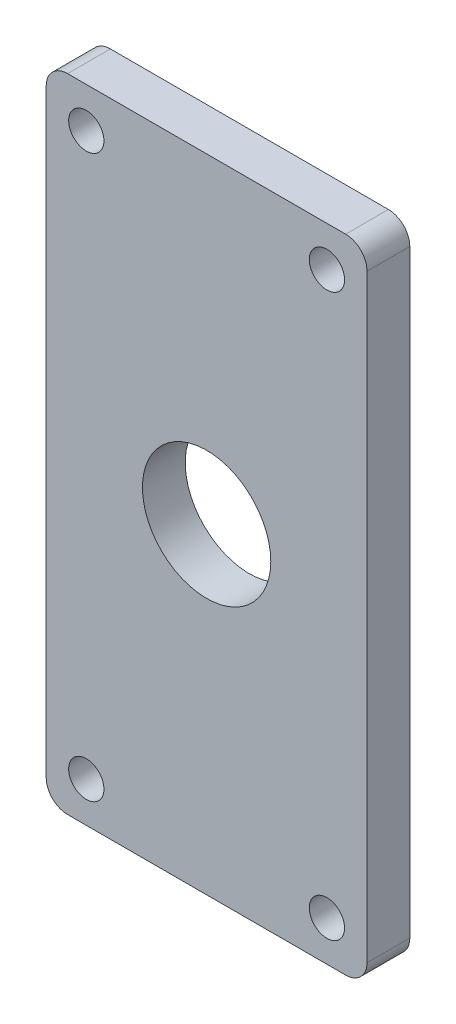
ISO-10303-21;
HEADER;
FILE_DESCRIPTION(('STEP AP214'),'2;1');
FILE_NAME('part.step','',(''),(''),'','','');
FILE_SCHEMA(('AUTOMOTIVE_DESIGN { 1 0 10303 214 1 1 1 1 }'));
ENDSEC;
DATA;
#1=APPLICATION_CONTEXT('core data for automotive mechanical design processes');
#2=APPLICATION_PROTOCOL_DEFINITION('international standard','automotive_design',2000,#1);
#3=PRODUCT_CONTEXT('',#1,'mechanical');
#4=PRODUCT('Part','Part','',(#3));
#5=PRODUCT_RELATED_PRODUCT_CATEGORY('part','',(#4));
#6=PRODUCT_DEFINITION_FORMATION('','',#4);
#7=PRODUCT_DEFINITION_CONTEXT('part definition',#1,'design');
#8=PRODUCT_DEFINITION('design','',#6,#7);
#9=PRODUCT_DEFINITION_SHAPE('','',#8);
#10=(LENGTH_UNIT() NAMED_UNIT(*) SI_UNIT(.MILLI.,.METRE.));
#11=(NAMED_UNIT(*) PLANE_ANGLE_UNIT() SI_UNIT($,.RADIAN.));
#12=(NAMED_UNIT(*) SI_UNIT($,.STERADIAN.) SOLID_ANGLE_UNIT());
#13=UNCERTAINTY_MEASURE_WITH_UNIT(LENGTH_MEASURE(1.E-05),#10,'distance_accuracy_value','');
#14=(GEOMETRIC_REPRESENTATION_CONTEXT(3) GLOBAL_UNCERTAINTY_ASSIGNED_CONTEXT((#13)) GLOBAL_UNIT_ASSIGNED_CONTEXT((#10,
#11,#12)) REPRESENTATION_CONTEXT('',''));
#15=CARTESIAN_POINT('',(0.,0.,0.));
#16=DIRECTION('',(0.,0.,1.));
#17=DIRECTION('',(1.,0.,0.));
#18=AXIS2_PLACEMENT_3D('',#15,#16,#17);
#19=CARTESIAN_POINT('',(-13.,-28.,4.));
#20=DIRECTION('',(0.,0.,-1.));
#21=DIRECTION('',(-1.,0.,0.));
#22=AXIS2_PLACEMENT_3D('',#19,#20,#21);
#23=CYLINDRICAL_SURFACE('',#22,2.);
#24=DIRECTION('',(0.,0.,1.));
#25=VECTOR('',#24,1.);
#26=CARTESIAN_POINT('',(-15.,-28.,4.));
#27=LINE('',#26,#25);
#28=CARTESIAN_POINT('',(-15.,-28.,0.));
#29=VERTEX_POINT('',#28);
#30=CARTESIAN_POINT('',(-15.,-28.,4.));
#31=VERTEX_POINT('',#30);
#32=EDGE_CURVE('E156',#29,#31,#27,.T.);
#33=ORIENTED_EDGE('',*,*,#32,.F.);
#34=CARTESIAN_POINT('',(-13.,-28.,0.));
#35=DIRECTION('',(0.,0.,1.));
#36=DIRECTION('',(1.,0.,0.));
#37=AXIS2_PLACEMENT_3D('',#34,#35,#36);
#38=CIRCLE('',#37,2.);
#39=CARTESIAN_POINT('',(-13.,-30.,0.));
#40=VERTEX_POINT('',#39);
#41=EDGE_CURVE('E46',#40,#29,#38,.F.);
#42=ORIENTED_EDGE('',*,*,#41,.F.);
#43=DIRECTION('',(0.,0.,1.));
#44=VECTOR('',#43,1.);
#45=CARTESIAN_POINT('',(-13.,-30.,4.));
#46=LINE('',#45,#44);
#47=CARTESIAN_POINT('',(-13.,-30.,4.));
#48=VERTEX_POINT('',#47);
#49=EDGE_CURVE('E159',#48,#40,#46,.F.);
#50=ORIENTED_EDGE('',*,*,#49,.F.);
#51=CARTESIAN_POINT('',(-13.,-28.,4.));
#52=DIRECTION('',(0.,0.,1.));
#53=DIRECTION('',(1.,0.,0.));
#54=AXIS2_PLACEMENT_3D('',#51,#52,#53);
#55=CIRCLE('',#54,2.);
#56=EDGE_CURVE('E11',#31,#48,#55,.T.);
#57=ORIENTED_EDGE('',*,*,#56,.F.);
#58=EDGE_LOOP('',(#33,#42,#50,#57));
#59=FACE_BOUND('',#58,.T.);
#60=ADVANCED_FACE('F39',(#59),#23,.T.);
#61=CARTESIAN_POINT('',(-13.,28.,4.));
#62=DIRECTION('',(0.,0.,1.));
#63=DIRECTION('',(1.,0.,0.));
#64=AXIS2_PLACEMENT_3D('',#61,#62,#63);
#65=CYLINDRICAL_SURFACE('',#64,2.);
#66=DIRECTION('',(0.,0.,1.));
#67=VECTOR('',#66,1.);
#68=CARTESIAN_POINT('',(-13.,30.,4.));
#69=LINE('',#68,#67);
#70=CARTESIAN_POINT('',(-13.,30.,0.));
#71=VERTEX_POINT('',#70);
#72=CARTESIAN_POINT('',(-13.,30.,4.));
#73=VERTEX_POINT('',#72);
#74=EDGE_CURVE('E147',#71,#73,#69,.T.);
#75=ORIENTED_EDGE('',*,*,#74,.F.);
#76=CARTESIAN_POINT('',(-13.,28.,0.));
#77=DIRECTION('',(0.,0.,1.));
#78=DIRECTION('',(1.,0.,0.));
#79=AXIS2_PLACEMENT_3D('',#76,#77,#78);
#80=CIRCLE('',#79,2.);
#81=CARTESIAN_POINT('',(-15.,28.,0.));
#82=VERTEX_POINT('',#81);
#83=EDGE_CURVE('E108',#82,#71,#80,.F.);
#84=ORIENTED_EDGE('',*,*,#83,.F.);
#85=DIRECTION('',(0.,0.,1.));
#86=VECTOR('',#85,1.);
#87=CARTESIAN_POINT('',(-15.,28.,4.));
#88=LINE('',#87,#86);
#89=CARTESIAN_POINT('',(-15.,28.,4.));
#90=VERTEX_POINT('',#89);
#91=EDGE_CURVE('E149',#90,#82,#88,.F.);
#92=ORIENTED_EDGE('',*,*,#91,.F.);
#93=CARTESIAN_POINT('',(-13.,28.,4.));
#94=DIRECTION('',(0.,0.,1.));
#95=DIRECTION('',(1.,0.,0.));
#96=AXIS2_PLACEMENT_3D('',#93,#94,#95);
#97=CIRCLE('',#96,2.);
#98=EDGE_CURVE('E153',#73,#90,#97,.T.);
#99=ORIENTED_EDGE('',*,*,#98,.F.);
#100=EDGE_LOOP('',(#75,#84,#92,#99));
#101=FACE_BOUND('',#100,.T.);
#102=ADVANCED_FACE('F196',(#101),#65,.T.);
#103=CARTESIAN_POINT('',(13.,-28.,4.));
#104=DIRECTION('',(0.,0.,-1.));
#105=DIRECTION('',(-1.,0.,0.));
#106=AXIS2_PLACEMENT_3D('',#103,#104,#105);
#107=CYLINDRICAL_SURFACE('',#106,2.);
#108=DIRECTION('',(0.,0.,-1.));
#109=VECTOR('',#108,1.);
#110=CARTESIAN_POINT('',(15.,-28.,4.));
#111=LINE('',#110,#109);
#112=CARTESIAN_POINT('',(15.,-28.,4.));
#113=VERTEX_POINT('',#112);
#114=CARTESIAN_POINT('',(15.,-28.,0.));
#115=VERTEX_POINT('',#114);
#116=EDGE_CURVE('E123',#113,#115,#111,.T.);
#117=ORIENTED_EDGE('',*,*,#116,.F.);
#118=CARTESIAN_POINT('',(13.,-28.,4.));
#119=DIRECTION('',(0.,0.,1.));
#120=DIRECTION('',(1.,0.,0.));
#121=AXIS2_PLACEMENT_3D('',#118,#119,#120);
#122=CIRCLE('',#121,2.);
#123=CARTESIAN_POINT('',(13.,-30.,4.));
#124=VERTEX_POINT('',#123);
#125=EDGE_CURVE('E142',#124,#113,#122,.T.);
#126=ORIENTED_EDGE('',*,*,#125,.F.);
#127=DIRECTION('',(0.,0.,-1.));
#128=VECTOR('',#127,1.);
#129=CARTESIAN_POINT('',(13.,-30.,4.));
#130=LINE('',#129,#128);
#131=CARTESIAN_POINT('',(13.,-30.,0.));
#132=VERTEX_POINT('',#131);
#133=EDGE_CURVE('E139',#132,#124,#130,.F.);
#134=ORIENTED_EDGE('',*,*,#133,.F.);
#135=CARTESIAN_POINT('',(13.,-28.,0.));
#136=DIRECTION('',(0.,0.,1.));
#137=DIRECTION('',(1.,0.,0.));
#138=AXIS2_PLACEMENT_3D('',#135,#136,#137);
#139=CIRCLE('',#138,2.);
#140=EDGE_CURVE('E144',#115,#132,#139,.F.);
#141=ORIENTED_EDGE('',*,*,#140,.F.);
#142=EDGE_LOOP('',(#117,#126,#134,#141));
#143=FACE_BOUND('',#142,.T.);
#144=ADVANCED_FACE('F190',(#143),#107,.T.);
#145=CARTESIAN_POINT('',(13.,28.,4.));
#146=DIRECTION('',(0.,0.,1.));
#147=DIRECTION('',(1.,0.,0.));
#148=AXIS2_PLACEMENT_3D('',#145,#146,#147);
#149=CYLINDRICAL_SURFACE('',#148,2.);
#150=DIRECTION('',(0.,0.,-1.));
#151=VECTOR('',#150,1.);
#152=CARTESIAN_POINT('',(13.,30.,4.));
#153=LINE('',#152,#151);
#154=CARTESIAN_POINT('',(13.,30.,4.));
#155=VERTEX_POINT('',#154);
#156=CARTESIAN_POINT('',(13.,30.,0.));
#157=VERTEX_POINT('',#156);
#158=EDGE_CURVE('E120',#155,#157,#153,.T.);
#159=ORIENTED_EDGE('',*,*,#158,.F.);
#160=CARTESIAN_POINT('',(13.,28.,4.));
#161=DIRECTION('',(0.,0.,1.));
#162=DIRECTION('',(1.,0.,0.));
#163=AXIS2_PLACEMENT_3D('',#160,#161,#162);
#164=CIRCLE('',#163,2.);
#165=CARTESIAN_POINT('',(15.,28.,4.));
#166=VERTEX_POINT('',#165);
#167=EDGE_CURVE('E124',#166,#155,#164,.T.);
#168=ORIENTED_EDGE('',*,*,#167,.F.);
#169=DIRECTION('',(0.,0.,-1.));
#170=VECTOR('',#169,1.);
#171=CARTESIAN_POINT('',(15.,28.,4.));
#172=LINE('',#171,#170);
#173=CARTESIAN_POINT('',(15.,28.,0.));
#174=VERTEX_POINT('',#173);
#175=EDGE_CURVE('E122',#174,#166,#172,.F.);
#176=ORIENTED_EDGE('',*,*,#175,.F.);
#177=CARTESIAN_POINT('',(13.,28.,0.));
#178=DIRECTION('',(0.,0.,1.));
#179=DIRECTION('',(1.,0.,0.));
#180=AXIS2_PLACEMENT_3D('',#177,#178,#179);
#181=CIRCLE('',#180,2.);
#182=EDGE_CURVE('E105',#157,#174,#181,.F.);
#183=ORIENTED_EDGE('',*,*,#182,.F.);
#184=EDGE_LOOP('',(#159,#168,#176,#183));
#185=FACE_BOUND('',#184,.T.);
#186=ADVANCED_FACE('F118',(#185),#149,.T.);
#187=CARTESIAN_POINT('',(0.,-30.,4.));
#188=DIRECTION('',(0.,1.,0.));
#189=DIRECTION('',(0.,0.,1.));
#190=AXIS2_PLACEMENT_3D('',#187,#188,#189);
#191=PLANE('',#190);
#192=DIRECTION('',(1.,0.,0.));
#193=VECTOR('',#192,1.);
#194=CARTESIAN_POINT('',(0.,-30.,4.));
#195=LINE('',#194,#193);
#196=EDGE_CURVE('E167',#48,#124,#195,.T.);
#197=ORIENTED_EDGE('',*,*,#196,.F.);
#198=ORIENTED_EDGE('',*,*,#49,.T.);
#199=DIRECTION('',(1.,0.,0.));
#200=VECTOR('',#199,1.);
#201=CARTESIAN_POINT('',(0.,-30.,0.));
#202=LINE('',#201,#200);
#203=EDGE_CURVE('E161',#40,#132,#202,.T.);
#204=ORIENTED_EDGE('',*,*,#203,.T.);
#205=ORIENTED_EDGE('',*,*,#133,.T.);
#206=EDGE_LOOP('',(#197,#198,#204,#205));
#207=FACE_BOUND('',#206,.T.);
#208=ADVANCED_FACE('F193',(#207),#191,.F.);
#209=CARTESIAN_POINT('',(15.,0.,4.));
#210=DIRECTION('',(-1.,0.,0.));
#211=DIRECTION('',(0.,0.,1.));
#212=AXIS2_PLACEMENT_3D('',#209,#210,#211);
#213=PLANE('',#212);
#214=DIRECTION('',(0.,1.,0.));
#215=VECTOR('',#214,1.);
#216=CARTESIAN_POINT('',(15.,0.,4.));
#217=LINE('',#216,#215);
#218=EDGE_CURVE('E171',#113,#166,#217,.T.);
#219=ORIENTED_EDGE('',*,*,#218,.F.);
#220=ORIENTED_EDGE('',*,*,#116,.T.);
#221=DIRECTION('',(0.,1.,0.));
#222=VECTOR('',#221,1.);
#223=CARTESIAN_POINT('',(15.,0.,0.));
#224=LINE('',#223,#222);
#225=EDGE_CURVE('E114',#115,#174,#224,.T.);
#226=ORIENTED_EDGE('',*,*,#225,.T.);
#227=ORIENTED_EDGE('',*,*,#175,.T.);
#228=EDGE_LOOP('',(#219,#220,#226,#227));
#229=FACE_BOUND('',#228,.T.);
#230=ADVANCED_FACE('F185',(#229),#213,.F.);
#231=CARTESIAN_POINT('',(0.,30.,4.));
#232=DIRECTION('',(0.,1.,0.));
#233=DIRECTION('',(0.,0.,1.));
#234=AXIS2_PLACEMENT_3D('',#231,#232,#233);
#235=PLANE('',#234);
#236=DIRECTION('',(1.,0.,0.));
#237=VECTOR('',#236,1.);
#238=CARTESIAN_POINT('',(0.,30.,0.));
#239=LINE('',#238,#237);
#240=EDGE_CURVE('E100',#71,#157,#239,.T.);
#241=ORIENTED_EDGE('',*,*,#240,.F.);
#242=ORIENTED_EDGE('',*,*,#74,.T.);
#243=DIRECTION('',(1.,0.,0.));
#244=VECTOR('',#243,1.);
#245=CARTESIAN_POINT('',(0.,30.,4.));
#246=LINE('',#245,#244);
#247=EDGE_CURVE('E128',#73,#155,#246,.T.);
#248=ORIENTED_EDGE('',*,*,#247,.T.);
#249=ORIENTED_EDGE('',*,*,#158,.T.);
#250=EDGE_LOOP('',(#241,#242,#248,#249));
#251=FACE_BOUND('',#250,.T.);
#252=ADVANCED_FACE('F126',(#251),#235,.T.);
#253=CARTESIAN_POINT('',(0.,0.,4.));
#254=DIRECTION('',(0.,0.,-1.));
#255=DIRECTION('',(-1.,0.,0.));
#256=AXIS2_PLACEMENT_3D('',#253,#254,#255);
#257=CYLINDRICAL_SURFACE('',#256,6.);
#258=CARTESIAN_POINT('',(0.,0.,4.));
#259=DIRECTION('',(0.,0.,1.));
#260=DIRECTION('',(1.,0.,0.));
#261=AXIS2_PLACEMENT_3D('',#258,#259,#260);
#262=CIRCLE('',#261,6.);
#263=CARTESIAN_POINT('',(6.,0.,4.));
#264=VERTEX_POINT('',#263);
#265=EDGE_CURVE('E165',#264,#264,#262,.T.);
#266=ORIENTED_EDGE('',*,*,#265,.T.);
#267=EDGE_LOOP('',(#266));
#268=FACE_BOUND('',#267,.T.);
#269=CARTESIAN_POINT('',(0.,0.,0.));
#270=DIRECTION('',(0.,0.,1.));
#271=DIRECTION('',(1.,0.,0.));
#272=AXIS2_PLACEMENT_3D('',#269,#270,#271);
#273=CIRCLE('',#272,6.);
#274=CARTESIAN_POINT('',(6.,0.,0.));
#275=VERTEX_POINT('',#274);
#276=EDGE_CURVE('E179',#275,#275,#273,.T.);
#277=ORIENTED_EDGE('',*,*,#276,.F.);
#278=EDGE_LOOP('',(#277));
#279=FACE_BOUND('',#278,.T.);
#280=ADVANCED_FACE('F206',(#268,#279),#257,.F.);
#281=CARTESIAN_POINT('',(-15.,0.,4.));
#282=DIRECTION('',(-1.,0.,0.));
#283=DIRECTION('',(0.,0.,1.));
#284=AXIS2_PLACEMENT_3D('',#281,#282,#283);
#285=PLANE('',#284);
#286=DIRECTION('',(0.,1.,0.));
#287=VECTOR('',#286,1.);
#288=CARTESIAN_POINT('',(-15.,0.,0.));
#289=LINE('',#288,#287);
#290=EDGE_CURVE('E113',#29,#82,#289,.T.);
#291=ORIENTED_EDGE('',*,*,#290,.F.);
#292=ORIENTED_EDGE('',*,*,#32,.T.);
#293=DIRECTION('',(0.,1.,0.));
#294=VECTOR('',#293,1.);
#295=CARTESIAN_POINT('',(-15.,0.,4.));
#296=LINE('',#295,#294);
#297=EDGE_CURVE('E130',#31,#90,#296,.T.);
#298=ORIENTED_EDGE('',*,*,#297,.T.);
#299=ORIENTED_EDGE('',*,*,#91,.T.);
#300=EDGE_LOOP('',(#291,#292,#298,#299));
#301=FACE_BOUND('',#300,.T.);
#302=ADVANCED_FACE('F163',(#301),#285,.T.);
#303=CARTESIAN_POINT('',(0.,0.,4.));
#304=DIRECTION('',(0.,0.,1.));
#305=DIRECTION('',(1.,0.,0.));
#306=AXIS2_PLACEMENT_3D('',#303,#304,#305);
#307=PLANE('',#306);
#308=CARTESIAN_POINT('',(-11.25,26.25,4.));
#309=DIRECTION('',(0.,0.,1.));
#310=DIRECTION('',(1.,0.,0.));
#311=AXIS2_PLACEMENT_3D('',#308,#309,#310);
#312=CIRCLE('',#311,1.64999999999999);
#313=CARTESIAN_POINT('',(-9.60000000000002,26.25,4.));
#314=VERTEX_POINT('',#313);
#315=EDGE_CURVE('E246',#314,#314,#312,.T.);
#316=ORIENTED_EDGE('',*,*,#315,.F.);
#317=EDGE_LOOP('',(#316));
#318=FACE_BOUND('',#317,.T.);
#319=CARTESIAN_POINT('',(11.25,26.25,4.));
#320=DIRECTION('',(0.,0.,1.));
#321=DIRECTION('',(1.,0.,0.));
#322=AXIS2_PLACEMENT_3D('',#319,#320,#321);
#323=CIRCLE('',#322,1.64999999999999);
#324=CARTESIAN_POINT('',(12.9,26.25,4.));
#325=VERTEX_POINT('',#324);
#326=EDGE_CURVE('E248',#325,#325,#323,.T.);
#327=ORIENTED_EDGE('',*,*,#326,.F.);
#328=EDGE_LOOP('',(#327));
#329=FACE_BOUND('',#328,.T.);
#330=CARTESIAN_POINT('',(11.25,-26.25,4.));
#331=DIRECTION('',(0.,0.,1.));
#332=DIRECTION('',(1.,0.,0.));
#333=AXIS2_PLACEMENT_3D('',#330,#331,#332);
#334=CIRCLE('',#333,1.64999999999999);
#335=CARTESIAN_POINT('',(12.9,-26.25,4.));
#336=VERTEX_POINT('',#335);
#337=EDGE_CURVE('E256',#336,#336,#334,.T.);
#338=ORIENTED_EDGE('',*,*,#337,.F.);
#339=EDGE_LOOP('',(#338));
#340=FACE_BOUND('',#339,.T.);
#341=CARTESIAN_POINT('',(-11.25,-26.25,4.));
#342=DIRECTION('',(0.,0.,1.));
#343=DIRECTION('',(1.,0.,0.));
#344=AXIS2_PLACEMENT_3D('',#341,#342,#343);
#345=CIRCLE('',#344,1.64999999999999);
#346=CARTESIAN_POINT('',(-9.60000000000002,-26.25,4.));
#347=VERTEX_POINT('',#346);
#348=EDGE_CURVE('E261',#347,#347,#345,.T.);
#349=ORIENTED_EDGE('',*,*,#348,.F.);
#350=EDGE_LOOP('',(#349));
#351=FACE_BOUND('',#350,.T.);
#352=ORIENTED_EDGE('',*,*,#265,.F.);
#353=EDGE_LOOP('',(#352));
#354=FACE_BOUND('',#353,.T.);
#355=ORIENTED_EDGE('',*,*,#297,.F.);
#356=ORIENTED_EDGE('',*,*,#56,.T.);
#357=ORIENTED_EDGE('',*,*,#196,.T.);
#358=ORIENTED_EDGE('',*,*,#125,.T.);
#359=ORIENTED_EDGE('',*,*,#218,.T.);
#360=ORIENTED_EDGE('',*,*,#167,.T.);
#361=ORIENTED_EDGE('',*,*,#247,.F.);
#362=ORIENTED_EDGE('',*,*,#98,.T.);
#363=EDGE_LOOP('',(#355,#356,#357,#358,#359,#360,#361,#362));
#364=FACE_BOUND('',#363,.T.);
#365=ADVANCED_FACE('F194',(#318,#329,#340,#351,#354,#364),#307,.T.);
#366=CARTESIAN_POINT('',(0.,0.,0.));
#367=DIRECTION('',(0.,0.,1.));
#368=DIRECTION('',(1.,0.,0.));
#369=AXIS2_PLACEMENT_3D('',#366,#367,#368);
#370=PLANE('',#369);
#371=CARTESIAN_POINT('',(-11.25,26.25,0.));
#372=DIRECTION('',(0.,0.,1.));
#373=DIRECTION('',(1.,0.,0.));
#374=AXIS2_PLACEMENT_3D('',#371,#372,#373);
#375=CIRCLE('',#374,1.65);
#376=CARTESIAN_POINT('',(-9.6,26.25,0.));
#377=VERTEX_POINT('',#376);
#378=EDGE_CURVE('E243',#377,#377,#375,.T.);
#379=ORIENTED_EDGE('',*,*,#378,.T.);
#380=EDGE_LOOP('',(#379));
#381=FACE_BOUND('',#380,.T.);
#382=CARTESIAN_POINT('',(11.25,26.25,0.));
#383=DIRECTION('',(0.,0.,1.));
#384=DIRECTION('',(1.,0.,0.));
#385=AXIS2_PLACEMENT_3D('',#382,#383,#384);
#386=CIRCLE('',#385,1.65);
#387=CARTESIAN_POINT('',(12.9,26.25,0.));
#388=VERTEX_POINT('',#387);
#389=EDGE_CURVE('E253',#388,#388,#386,.T.);
#390=ORIENTED_EDGE('',*,*,#389,.T.);
#391=EDGE_LOOP('',(#390));
#392=FACE_BOUND('',#391,.T.);
#393=CARTESIAN_POINT('',(11.25,-26.25,0.));
#394=DIRECTION('',(0.,0.,1.));
#395=DIRECTION('',(1.,0.,0.));
#396=AXIS2_PLACEMENT_3D('',#393,#394,#395);
#397=CIRCLE('',#396,1.65);
#398=CARTESIAN_POINT('',(12.9,-26.25,0.));
#399=VERTEX_POINT('',#398);
#400=EDGE_CURVE('E259',#399,#399,#397,.T.);
#401=ORIENTED_EDGE('',*,*,#400,.T.);
#402=EDGE_LOOP('',(#401));
#403=FACE_BOUND('',#402,.T.);
#404=CARTESIAN_POINT('',(-11.25,-26.25,0.));
#405=DIRECTION('',(0.,0.,1.));
#406=DIRECTION('',(1.,0.,0.));
#407=AXIS2_PLACEMENT_3D('',#404,#405,#406);
#408=CIRCLE('',#407,1.65);
#409=CARTESIAN_POINT('',(-9.6,-26.25,0.));
#410=VERTEX_POINT('',#409);
#411=EDGE_CURVE('E174',#410,#410,#408,.T.);
#412=ORIENTED_EDGE('',*,*,#411,.T.);
#413=EDGE_LOOP('',(#412));
#414=FACE_BOUND('',#413,.T.);
#415=ORIENTED_EDGE('',*,*,#276,.T.);
#416=EDGE_LOOP('',(#415));
#417=FACE_BOUND('',#416,.T.);
#418=ORIENTED_EDGE('',*,*,#203,.F.);
#419=ORIENTED_EDGE('',*,*,#41,.T.);
#420=ORIENTED_EDGE('',*,*,#290,.T.);
#421=ORIENTED_EDGE('',*,*,#83,.T.);
#422=ORIENTED_EDGE('',*,*,#240,.T.);
#423=ORIENTED_EDGE('',*,*,#182,.T.);
#424=ORIENTED_EDGE('',*,*,#225,.F.);
#425=ORIENTED_EDGE('',*,*,#140,.T.);
#426=EDGE_LOOP('',(#418,#419,#420,#421,#422,#423,#424,#425));
#427=FACE_BOUND('',#426,.T.);
#428=ADVANCED_FACE('F103',(#381,#392,#403,#414,#417,#427),#370,.F.);
#429=CARTESIAN_POINT('',(-11.25,-26.25,4.));
#430=DIRECTION('',(0.,0.,1.));
#431=DIRECTION('',(1.,0.,0.));
#432=AXIS2_PLACEMENT_3D('',#429,#430,#431);
#433=CYLINDRICAL_SURFACE('',#432,1.64999999999999);
#434=ORIENTED_EDGE('',*,*,#411,.F.);
#435=EDGE_LOOP('',(#434));
#436=FACE_BOUND('',#435,.T.);
#437=ORIENTED_EDGE('',*,*,#348,.T.);
#438=EDGE_LOOP('',(#437));
#439=FACE_BOUND('',#438,.T.);
#440=ADVANCED_FACE('F219',(#436,#439),#433,.F.);
#441=CARTESIAN_POINT('',(11.25,-26.25,4.));
#442=DIRECTION('',(0.,0.,1.));
#443=DIRECTION('',(1.,0.,0.));
#444=AXIS2_PLACEMENT_3D('',#441,#442,#443);
#445=CYLINDRICAL_SURFACE('',#444,1.64999999999999);
#446=ORIENTED_EDGE('',*,*,#400,.F.);
#447=EDGE_LOOP('',(#446));
#448=FACE_BOUND('',#447,.T.);
#449=ORIENTED_EDGE('',*,*,#337,.T.);
#450=EDGE_LOOP('',(#449));
#451=FACE_BOUND('',#450,.T.);
#452=ADVANCED_FACE('F226',(#448,#451),#445,.F.);
#453=CARTESIAN_POINT('',(11.25,26.25,4.));
#454=DIRECTION('',(0.,0.,1.));
#455=DIRECTION('',(1.,0.,0.));
#456=AXIS2_PLACEMENT_3D('',#453,#454,#455);
#457=CYLINDRICAL_SURFACE('',#456,1.64999999999999);
#458=ORIENTED_EDGE('',*,*,#389,.F.);
#459=EDGE_LOOP('',(#458));
#460=FACE_BOUND('',#459,.T.);
#461=ORIENTED_EDGE('',*,*,#326,.T.);
#462=EDGE_LOOP('',(#461));
#463=FACE_BOUND('',#462,.T.);
#464=ADVANCED_FACE('F230',(#460,#463),#457,.F.);
#465=CARTESIAN_POINT('',(-11.25,26.25,4.));
#466=DIRECTION('',(0.,0.,1.));
#467=DIRECTION('',(1.,0.,0.));
#468=AXIS2_PLACEMENT_3D('',#465,#466,#467);
#469=CYLINDRICAL_SURFACE('',#468,1.64999999999999);
#470=ORIENTED_EDGE('',*,*,#378,.F.);
#471=EDGE_LOOP('',(#470));
#472=FACE_BOUND('',#471,.T.);
#473=ORIENTED_EDGE('',*,*,#315,.T.);
#474=EDGE_LOOP('',(#473));
#475=FACE_BOUND('',#474,.T.);
#476=ADVANCED_FACE('F234',(#472,#475),#469,.F.);
#477=CLOSED_SHELL('',(#60,#102,#144,#186,#208,#230,#252,#280,#302,#365,#428,#440,#452,#464,#476));
#478=MANIFOLD_SOLID_BREP('B2',#477);
#479=ADVANCED_BREP_SHAPE_REPRESENTATION('',(#18,#478),#14);
#480=SHAPE_DEFINITION_REPRESENTATION(#9,#479);
ENDSEC;
END-ISO-10303-21;
